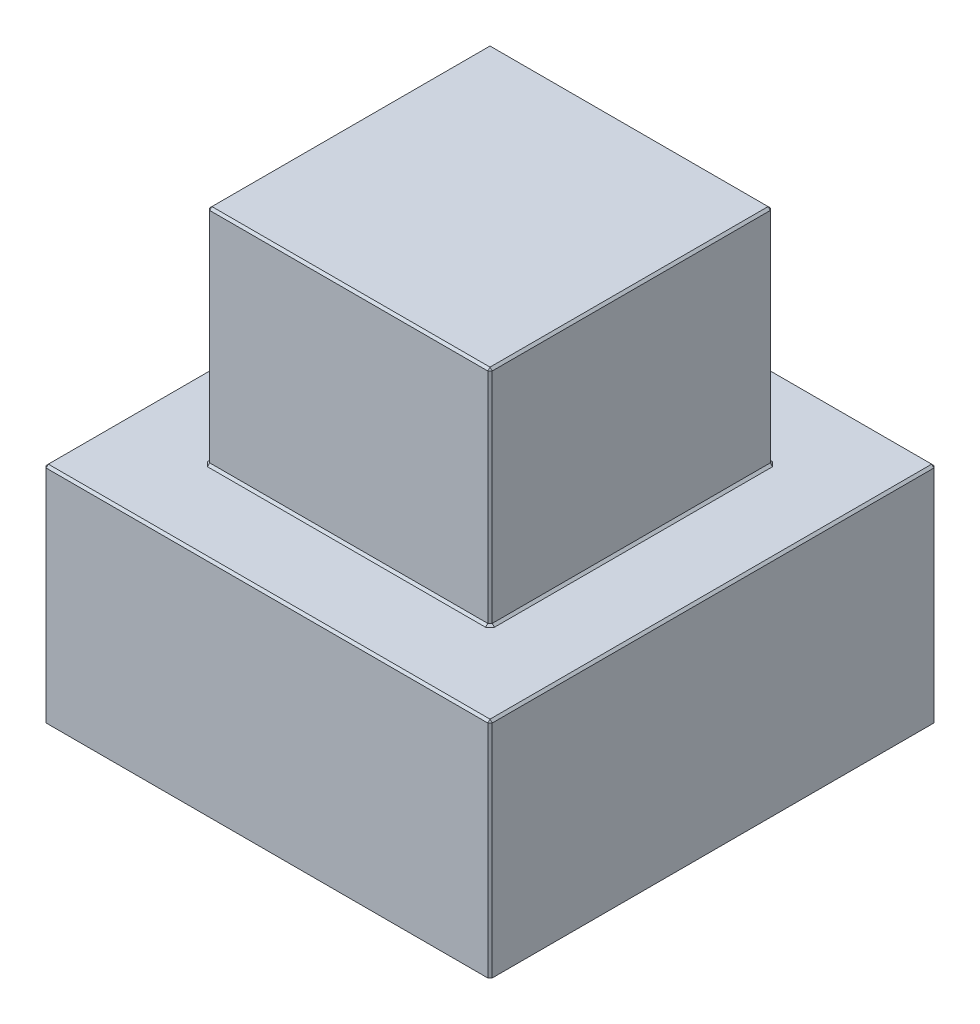
ISO-10303-21;
HEADER;
FILE_DESCRIPTION(('STEP AP214'),'2;1');
FILE_NAME('part.step','',(''),(''),'','','');
FILE_SCHEMA(('AUTOMOTIVE_DESIGN { 1 0 10303 214 1 1 1 1 }'));
ENDSEC;
DATA;
#1=APPLICATION_CONTEXT('core data for automotive mechanical design processes');
#2=APPLICATION_PROTOCOL_DEFINITION('international standard','automotive_design',2000,#1);
#3=PRODUCT_CONTEXT('',#1,'mechanical');
#4=PRODUCT('Part','Part','',(#3));
#5=PRODUCT_RELATED_PRODUCT_CATEGORY('part','',(#4));
#6=PRODUCT_DEFINITION_FORMATION('','',#4);
#7=PRODUCT_DEFINITION_CONTEXT('part definition',#1,'design');
#8=PRODUCT_DEFINITION('design','',#6,#7);
#9=PRODUCT_DEFINITION_SHAPE('','',#8);
#10=(LENGTH_UNIT() NAMED_UNIT(*) SI_UNIT(.MILLI.,.METRE.));
#11=(NAMED_UNIT(*) PLANE_ANGLE_UNIT() SI_UNIT($,.RADIAN.));
#12=(NAMED_UNIT(*) SI_UNIT($,.STERADIAN.) SOLID_ANGLE_UNIT());
#13=UNCERTAINTY_MEASURE_WITH_UNIT(LENGTH_MEASURE(1.E-05),#10,'distance_accuracy_value','');
#14=(GEOMETRIC_REPRESENTATION_CONTEXT(3) GLOBAL_UNCERTAINTY_ASSIGNED_CONTEXT((#13)) GLOBAL_UNIT_ASSIGNED_CONTEXT((#10,
#11,#12)) REPRESENTATION_CONTEXT('',''));
#15=CARTESIAN_POINT('',(0.,0.,0.));
#16=DIRECTION('',(0.,0.,1.));
#17=DIRECTION('',(1.,0.,0.));
#18=AXIS2_PLACEMENT_3D('',#15,#16,#17);
#19=CARTESIAN_POINT('',(0.,3.,0.));
#20=DIRECTION('',(0.,-1.,0.));
#21=DIRECTION('',(0.,0.,-1.));
#22=AXIS2_PLACEMENT_3D('',#19,#20,#21);
#23=PLANE('',#22);
#24=DIRECTION('',(1.,0.,0.));
#25=VECTOR('',#24,1.);
#26=CARTESIAN_POINT('',(0.,3.,2.97));
#27=LINE('',#26,#25);
#28=CARTESIAN_POINT('',(-2.97,3.,2.97));
#29=VERTEX_POINT('',#28);
#30=CARTESIAN_POINT('',(2.97,3.,2.97));
#31=VERTEX_POINT('',#30);
#32=EDGE_CURVE('E447',#29,#31,#27,.T.);
#33=ORIENTED_EDGE('',*,*,#32,.T.);
#34=DIRECTION('',(0.,0.,-1.));
#35=VECTOR('',#34,1.);
#36=CARTESIAN_POINT('',(2.97,3.,0.));
#37=LINE('',#36,#35);
#38=CARTESIAN_POINT('',(2.97,3.,-2.97));
#39=VERTEX_POINT('',#38);
#40=EDGE_CURVE('E449',#31,#39,#37,.T.);
#41=ORIENTED_EDGE('',*,*,#40,.T.);
#42=DIRECTION('',(-1.,0.,0.));
#43=VECTOR('',#42,1.);
#44=CARTESIAN_POINT('',(0.,3.,-2.97));
#45=LINE('',#44,#43);
#46=CARTESIAN_POINT('',(-2.97,3.,-2.97));
#47=VERTEX_POINT('',#46);
#48=EDGE_CURVE('E443',#39,#47,#45,.T.);
#49=ORIENTED_EDGE('',*,*,#48,.T.);
#50=DIRECTION('',(0.,0.,1.));
#51=VECTOR('',#50,1.);
#52=CARTESIAN_POINT('',(-2.97,3.,0.));
#53=LINE('',#52,#51);
#54=EDGE_CURVE('E445',#47,#29,#53,.T.);
#55=ORIENTED_EDGE('',*,*,#54,.T.);
#56=EDGE_LOOP('',(#33,#41,#49,#55));
#57=FACE_BOUND('',#56,.T.);
#58=DIRECTION('',(-0.707106781186548,0.,-0.707106781186548));
#59=VECTOR('',#58,1.);
#60=CARTESIAN_POINT('',(1.87,3.,-1.93));
#61=LINE('',#60,#59);
#62=CARTESIAN_POINT('',(1.9,3.,-1.9));
#63=VERTEX_POINT('',#62);
#64=CARTESIAN_POINT('',(1.87,3.,-1.93));
#65=VERTEX_POINT('',#64);
#66=EDGE_CURVE('E239',#63,#65,#61,.T.);
#67=ORIENTED_EDGE('',*,*,#66,.F.);
#68=DIRECTION('',(-0.707106781186548,0.,-0.707106781186548));
#69=VECTOR('',#68,1.);
#70=CARTESIAN_POINT('',(1.87,3.,-1.93));
#71=LINE('',#70,#69);
#72=CARTESIAN_POINT('',(1.93,3.,-1.87));
#73=VERTEX_POINT('',#72);
#74=EDGE_CURVE('E234',#73,#63,#71,.T.);
#75=ORIENTED_EDGE('',*,*,#74,.F.);
#76=DIRECTION('',(0.,0.,1.));
#77=VECTOR('',#76,1.);
#78=CARTESIAN_POINT('',(1.93,3.,1.9));
#79=LINE('',#78,#77);
#80=CARTESIAN_POINT('',(1.93,3.,1.87));
#81=VERTEX_POINT('',#80);
#82=EDGE_CURVE('E229',#73,#81,#79,.T.);
#83=ORIENTED_EDGE('',*,*,#82,.T.);
#84=DIRECTION('',(0.707106781186548,0.,-0.707106781186548));
#85=VECTOR('',#84,1.);
#86=CARTESIAN_POINT('',(1.93,3.,1.87));
#87=LINE('',#86,#85);
#88=CARTESIAN_POINT('',(1.9,3.,1.9));
#89=VERTEX_POINT('',#88);
#90=EDGE_CURVE('E226',#89,#81,#87,.T.);
#91=ORIENTED_EDGE('',*,*,#90,.F.);
#92=DIRECTION('',(0.707106781186548,0.,-0.707106781186548));
#93=VECTOR('',#92,1.);
#94=CARTESIAN_POINT('',(1.93,3.,1.87));
#95=LINE('',#94,#93);
#96=CARTESIAN_POINT('',(1.87,3.,1.93));
#97=VERTEX_POINT('',#96);
#98=EDGE_CURVE('E219',#97,#89,#95,.T.);
#99=ORIENTED_EDGE('',*,*,#98,.F.);
#100=DIRECTION('',(-1.,0.,0.));
#101=VECTOR('',#100,1.);
#102=CARTESIAN_POINT('',(-1.9,3.,1.93));
#103=LINE('',#102,#101);
#104=CARTESIAN_POINT('',(-1.87,3.,1.93));
#105=VERTEX_POINT('',#104);
#106=EDGE_CURVE('E458',#97,#105,#103,.T.);
#107=ORIENTED_EDGE('',*,*,#106,.T.);
#108=DIRECTION('',(0.707106781186548,0.,0.707106781186548));
#109=VECTOR('',#108,1.);
#110=CARTESIAN_POINT('',(-1.87,3.,1.93));
#111=LINE('',#110,#109);
#112=CARTESIAN_POINT('',(-1.9,3.,1.9));
#113=VERTEX_POINT('',#112);
#114=EDGE_CURVE('E452',#113,#105,#111,.T.);
#115=ORIENTED_EDGE('',*,*,#114,.F.);
#116=DIRECTION('',(0.707106781186548,0.,0.707106781186548));
#117=VECTOR('',#116,1.);
#118=CARTESIAN_POINT('',(-1.87,3.,1.93));
#119=LINE('',#118,#117);
#120=CARTESIAN_POINT('',(-1.93,3.,1.87));
#121=VERTEX_POINT('',#120);
#122=EDGE_CURVE('E455',#121,#113,#119,.T.);
#123=ORIENTED_EDGE('',*,*,#122,.F.);
#124=DIRECTION('',(0.,0.,-1.));
#125=VECTOR('',#124,1.);
#126=CARTESIAN_POINT('',(-1.93,3.,-1.9));
#127=LINE('',#126,#125);
#128=CARTESIAN_POINT('',(-1.93,3.,-1.87));
#129=VERTEX_POINT('',#128);
#130=EDGE_CURVE('E216',#121,#129,#127,.T.);
#131=ORIENTED_EDGE('',*,*,#130,.T.);
#132=DIRECTION('',(-0.707106781186548,0.,0.707106781186548));
#133=VECTOR('',#132,1.);
#134=CARTESIAN_POINT('',(-1.93,3.,-1.87));
#135=LINE('',#134,#133);
#136=CARTESIAN_POINT('',(-1.9,3.,-1.9));
#137=VERTEX_POINT('',#136);
#138=EDGE_CURVE('E210',#137,#129,#135,.T.);
#139=ORIENTED_EDGE('',*,*,#138,.F.);
#140=DIRECTION('',(-0.707106781186548,0.,0.707106781186548));
#141=VECTOR('',#140,1.);
#142=CARTESIAN_POINT('',(-1.93,3.,-1.87));
#143=LINE('',#142,#141);
#144=CARTESIAN_POINT('',(-1.87,3.,-1.93));
#145=VERTEX_POINT('',#144);
#146=EDGE_CURVE('E213',#145,#137,#143,.T.);
#147=ORIENTED_EDGE('',*,*,#146,.F.);
#148=DIRECTION('',(1.,0.,0.));
#149=VECTOR('',#148,1.);
#150=CARTESIAN_POINT('',(1.9,3.,-1.93));
#151=LINE('',#150,#149);
#152=EDGE_CURVE('E237',#145,#65,#151,.T.);
#153=ORIENTED_EDGE('',*,*,#152,.T.);
#154=EDGE_LOOP('',(#67,#75,#83,#91,#99,#107,#115,#123,#131,#139,#147,#153));
#155=FACE_BOUND('',#154,.T.);
#156=ADVANCED_FACE('F39',(#57,#155),#23,.F.);
#157=CARTESIAN_POINT('',(3.,3.,3.));
#158=DIRECTION('',(-1.,0.,0.));
#159=DIRECTION('',(0.,0.,1.));
#160=AXIS2_PLACEMENT_3D('',#157,#158,#159);
#161=PLANE('',#160);
#162=DIRECTION('',(0.,0.,1.));
#163=VECTOR('',#162,1.);
#164=CARTESIAN_POINT('',(3.,2.97,3.));
#165=LINE('',#164,#163);
#166=CARTESIAN_POINT('',(3.,2.97,-2.97));
#167=VERTEX_POINT('',#166);
#168=CARTESIAN_POINT('',(3.,2.97,2.97));
#169=VERTEX_POINT('',#168);
#170=EDGE_CURVE('E273',#167,#169,#165,.T.);
#171=ORIENTED_EDGE('',*,*,#170,.T.);
#172=DIRECTION('',(0.,-1.,0.));
#173=VECTOR('',#172,1.);
#174=CARTESIAN_POINT('',(3.,3.,2.97));
#175=LINE('',#174,#173);
#176=CARTESIAN_POINT('',(3.,0.,2.97));
#177=VERTEX_POINT('',#176);
#178=EDGE_CURVE('E275',#169,#177,#175,.T.);
#179=ORIENTED_EDGE('',*,*,#178,.T.);
#180=DIRECTION('',(0.,0.,-1.));
#181=VECTOR('',#180,1.);
#182=CARTESIAN_POINT('',(3.,0.,3.));
#183=LINE('',#182,#181);
#184=CARTESIAN_POINT('',(3.,0.,-2.97));
#185=VERTEX_POINT('',#184);
#186=EDGE_CURVE('E345',#177,#185,#183,.T.);
#187=ORIENTED_EDGE('',*,*,#186,.T.);
#188=DIRECTION('',(0.,1.,0.));
#189=VECTOR('',#188,1.);
#190=CARTESIAN_POINT('',(3.,3.,-2.97));
#191=LINE('',#190,#189);
#192=EDGE_CURVE('E271',#185,#167,#191,.T.);
#193=ORIENTED_EDGE('',*,*,#192,.T.);
#194=EDGE_LOOP('',(#171,#179,#187,#193));
#195=FACE_BOUND('',#194,.T.);
#196=ADVANCED_FACE('F530',(#195),#161,.F.);
#197=CARTESIAN_POINT('',(-3.,3.,-3.));
#198=DIRECTION('',(0.,0.,1.));
#199=DIRECTION('',(1.,0.,0.));
#200=AXIS2_PLACEMENT_3D('',#197,#198,#199);
#201=PLANE('',#200);
#202=DIRECTION('',(-1.,0.,0.));
#203=VECTOR('',#202,1.);
#204=CARTESIAN_POINT('',(-3.,0.,-3.));
#205=LINE('',#204,#203);
#206=CARTESIAN_POINT('',(2.97,0.,-3.));
#207=VERTEX_POINT('',#206);
#208=CARTESIAN_POINT('',(-2.97,0.,-3.));
#209=VERTEX_POINT('',#208);
#210=EDGE_CURVE('E390',#207,#209,#205,.T.);
#211=ORIENTED_EDGE('',*,*,#210,.T.);
#212=DIRECTION('',(0.,1.,0.));
#213=VECTOR('',#212,1.);
#214=CARTESIAN_POINT('',(-2.97,3.,-3.));
#215=LINE('',#214,#213);
#216=CARTESIAN_POINT('',(-2.97,2.97,-3.));
#217=VERTEX_POINT('',#216);
#218=EDGE_CURVE('E11',#209,#217,#215,.T.);
#219=ORIENTED_EDGE('',*,*,#218,.T.);
#220=DIRECTION('',(1.,0.,0.));
#221=VECTOR('',#220,1.);
#222=CARTESIAN_POINT('',(-3.,2.97,-3.));
#223=LINE('',#222,#221);
#224=CARTESIAN_POINT('',(2.97,2.97,-3.));
#225=VERTEX_POINT('',#224);
#226=EDGE_CURVE('E49',#217,#225,#223,.T.);
#227=ORIENTED_EDGE('',*,*,#226,.T.);
#228=DIRECTION('',(0.,-1.,0.));
#229=VECTOR('',#228,1.);
#230=CARTESIAN_POINT('',(2.97,3.,-3.));
#231=LINE('',#230,#229);
#232=EDGE_CURVE('E277',#225,#207,#231,.T.);
#233=ORIENTED_EDGE('',*,*,#232,.T.);
#234=EDGE_LOOP('',(#211,#219,#227,#233));
#235=FACE_BOUND('',#234,.T.);
#236=ADVANCED_FACE('F389',(#235),#201,.F.);
#237=CARTESIAN_POINT('',(-3.,3.,3.));
#238=DIRECTION('',(1.,0.,0.));
#239=DIRECTION('',(0.,0.,-1.));
#240=AXIS2_PLACEMENT_3D('',#237,#238,#239);
#241=PLANE('',#240);
#242=DIRECTION('',(0.,0.,1.));
#243=VECTOR('',#242,1.);
#244=CARTESIAN_POINT('',(-3.,0.,3.));
#245=LINE('',#244,#243);
#246=CARTESIAN_POINT('',(-3.,0.,-2.97));
#247=VERTEX_POINT('',#246);
#248=CARTESIAN_POINT('',(-3.,0.,2.97));
#249=VERTEX_POINT('',#248);
#250=EDGE_CURVE('E398',#247,#249,#245,.T.);
#251=ORIENTED_EDGE('',*,*,#250,.T.);
#252=DIRECTION('',(0.,1.,0.));
#253=VECTOR('',#252,1.);
#254=CARTESIAN_POINT('',(-3.,3.,2.97));
#255=LINE('',#254,#253);
#256=CARTESIAN_POINT('',(-3.,2.97,2.97));
#257=VERTEX_POINT('',#256);
#258=EDGE_CURVE('E269',#249,#257,#255,.T.);
#259=ORIENTED_EDGE('',*,*,#258,.T.);
#260=DIRECTION('',(0.,0.,-1.));
#261=VECTOR('',#260,1.);
#262=CARTESIAN_POINT('',(-3.,2.97,3.));
#263=LINE('',#262,#261);
#264=CARTESIAN_POINT('',(-3.,2.97,-2.97));
#265=VERTEX_POINT('',#264);
#266=EDGE_CURVE('E267',#257,#265,#263,.T.);
#267=ORIENTED_EDGE('',*,*,#266,.T.);
#268=DIRECTION('',(0.,-1.,0.));
#269=VECTOR('',#268,1.);
#270=CARTESIAN_POINT('',(-3.,3.,-2.97));
#271=LINE('',#270,#269);
#272=EDGE_CURVE('E265',#265,#247,#271,.T.);
#273=ORIENTED_EDGE('',*,*,#272,.T.);
#274=EDGE_LOOP('',(#251,#259,#267,#273));
#275=FACE_BOUND('',#274,.T.);
#276=ADVANCED_FACE('F547',(#275),#241,.F.);
#277=CARTESIAN_POINT('',(-3.,3.,3.));
#278=DIRECTION('',(0.,0.,-1.));
#279=DIRECTION('',(-1.,0.,0.));
#280=AXIS2_PLACEMENT_3D('',#277,#278,#279);
#281=PLANE('',#280);
#282=DIRECTION('',(-1.,0.,0.));
#283=VECTOR('',#282,1.);
#284=CARTESIAN_POINT('',(-3.,2.97,3.));
#285=LINE('',#284,#283);
#286=CARTESIAN_POINT('',(2.97,2.97,3.));
#287=VERTEX_POINT('',#286);
#288=CARTESIAN_POINT('',(-2.97,2.97,3.));
#289=VERTEX_POINT('',#288);
#290=EDGE_CURVE('E250',#287,#289,#285,.T.);
#291=ORIENTED_EDGE('',*,*,#290,.T.);
#292=DIRECTION('',(0.,-1.,0.));
#293=VECTOR('',#292,1.);
#294=CARTESIAN_POINT('',(-2.97,3.,3.));
#295=LINE('',#294,#293);
#296=CARTESIAN_POINT('',(-2.97,0.,3.));
#297=VERTEX_POINT('',#296);
#298=EDGE_CURVE('E254',#289,#297,#295,.T.);
#299=ORIENTED_EDGE('',*,*,#298,.T.);
#300=DIRECTION('',(1.,0.,0.));
#301=VECTOR('',#300,1.);
#302=CARTESIAN_POINT('',(-3.,0.,3.));
#303=LINE('',#302,#301);
#304=CARTESIAN_POINT('',(2.97,0.,3.));
#305=VERTEX_POINT('',#304);
#306=EDGE_CURVE('E401',#297,#305,#303,.T.);
#307=ORIENTED_EDGE('',*,*,#306,.T.);
#308=DIRECTION('',(0.,1.,0.));
#309=VECTOR('',#308,1.);
#310=CARTESIAN_POINT('',(2.97,3.,3.));
#311=LINE('',#310,#309);
#312=EDGE_CURVE('E252',#305,#287,#311,.T.);
#313=ORIENTED_EDGE('',*,*,#312,.T.);
#314=EDGE_LOOP('',(#291,#299,#307,#313));
#315=FACE_BOUND('',#314,.T.);
#316=ADVANCED_FACE('F544',(#315),#281,.F.);
#317=CARTESIAN_POINT('',(0.,0.,0.));
#318=DIRECTION('',(0.,-1.,0.));
#319=DIRECTION('',(0.,0.,-1.));
#320=AXIS2_PLACEMENT_3D('',#317,#318,#319);
#321=PLANE('',#320);
#322=ORIENTED_EDGE('',*,*,#306,.F.);
#323=DIRECTION('',(0.707106781186548,0.,0.707106781186548));
#324=VECTOR('',#323,1.);
#325=CARTESIAN_POINT('',(-2.985,0.,2.985));
#326=LINE('',#325,#324);
#327=EDGE_CURVE('E263',#297,#249,#326,.F.);
#328=ORIENTED_EDGE('',*,*,#327,.T.);
#329=ORIENTED_EDGE('',*,*,#250,.F.);
#330=DIRECTION('',(-0.707106781186548,0.,0.707106781186548));
#331=VECTOR('',#330,1.);
#332=CARTESIAN_POINT('',(-2.985,0.,-2.985));
#333=LINE('',#332,#331);
#334=EDGE_CURVE('E259',#247,#209,#333,.F.);
#335=ORIENTED_EDGE('',*,*,#334,.T.);
#336=ORIENTED_EDGE('',*,*,#210,.F.);
#337=DIRECTION('',(-0.707106781186548,0.,-0.707106781186548));
#338=VECTOR('',#337,1.);
#339=CARTESIAN_POINT('',(2.985,0.,-2.985));
#340=LINE('',#339,#338);
#341=EDGE_CURVE('E257',#207,#185,#340,.F.);
#342=ORIENTED_EDGE('',*,*,#341,.T.);
#343=ORIENTED_EDGE('',*,*,#186,.F.);
#344=DIRECTION('',(0.707106781186548,0.,-0.707106781186548));
#345=VECTOR('',#344,1.);
#346=CARTESIAN_POINT('',(2.985,0.,2.985));
#347=LINE('',#346,#345);
#348=EDGE_CURVE('E261',#177,#305,#347,.F.);
#349=ORIENTED_EDGE('',*,*,#348,.T.);
#350=EDGE_LOOP('',(#322,#328,#329,#335,#336,#342,#343,#349));
#351=FACE_BOUND('',#350,.T.);
#352=ADVANCED_FACE('F393',(#351),#321,.T.);
#353=CARTESIAN_POINT('',(1.9,6.,1.9));
#354=DIRECTION('',(-1.,0.,0.));
#355=DIRECTION('',(0.,0.,1.));
#356=AXIS2_PLACEMENT_3D('',#353,#354,#355);
#357=PLANE('',#356);
#358=DIRECTION('',(0.,0.,-1.));
#359=VECTOR('',#358,1.);
#360=CARTESIAN_POINT('',(1.9,3.03,-1.9));
#361=LINE('',#360,#359);
#362=CARTESIAN_POINT('',(1.9,3.03,1.87));
#363=VERTEX_POINT('',#362);
#364=CARTESIAN_POINT('',(1.9,3.03,-1.87));
#365=VERTEX_POINT('',#364);
#366=EDGE_CURVE('E420',#363,#365,#361,.T.);
#367=ORIENTED_EDGE('',*,*,#366,.T.);
#368=DIRECTION('',(0.,1.,0.));
#369=VECTOR('',#368,1.);
#370=CARTESIAN_POINT('',(1.9,6.,-1.87));
#371=LINE('',#370,#369);
#372=CARTESIAN_POINT('',(1.9,5.97,-1.87));
#373=VERTEX_POINT('',#372);
#374=EDGE_CURVE('E422',#365,#373,#371,.T.);
#375=ORIENTED_EDGE('',*,*,#374,.T.);
#376=DIRECTION('',(0.,0.,1.));
#377=VECTOR('',#376,1.);
#378=CARTESIAN_POINT('',(1.9,5.97,1.9));
#379=LINE('',#378,#377);
#380=CARTESIAN_POINT('',(1.9,5.97,1.87));
#381=VERTEX_POINT('',#380);
#382=EDGE_CURVE('E418',#373,#381,#379,.T.);
#383=ORIENTED_EDGE('',*,*,#382,.T.);
#384=DIRECTION('',(0.,-1.,0.));
#385=VECTOR('',#384,1.);
#386=CARTESIAN_POINT('',(1.9,6.,1.87));
#387=LINE('',#386,#385);
#388=EDGE_CURVE('E416',#381,#363,#387,.T.);
#389=ORIENTED_EDGE('',*,*,#388,.T.);
#390=EDGE_LOOP('',(#367,#375,#383,#389));
#391=FACE_BOUND('',#390,.T.);
#392=ADVANCED_FACE('F540',(#391),#357,.F.);
#393=CARTESIAN_POINT('',(-1.9,6.,-1.9));
#394=DIRECTION('',(0.,0.,1.));
#395=DIRECTION('',(1.,0.,0.));
#396=AXIS2_PLACEMENT_3D('',#393,#394,#395);
#397=PLANE('',#396);
#398=DIRECTION('',(1.,0.,0.));
#399=VECTOR('',#398,1.);
#400=CARTESIAN_POINT('',(-1.9,5.97,-1.9));
#401=LINE('',#400,#399);
#402=CARTESIAN_POINT('',(-1.87,5.97,-1.9));
#403=VERTEX_POINT('',#402);
#404=CARTESIAN_POINT('',(1.87,5.97,-1.9));
#405=VERTEX_POINT('',#404);
#406=EDGE_CURVE('E411',#403,#405,#401,.T.);
#407=ORIENTED_EDGE('',*,*,#406,.T.);
#408=DIRECTION('',(0.,-1.,0.));
#409=VECTOR('',#408,1.);
#410=CARTESIAN_POINT('',(1.87,6.,-1.9));
#411=LINE('',#410,#409);
#412=CARTESIAN_POINT('',(1.87,3.03,-1.9));
#413=VERTEX_POINT('',#412);
#414=EDGE_CURVE('E413',#405,#413,#411,.T.);
#415=ORIENTED_EDGE('',*,*,#414,.T.);
#416=DIRECTION('',(-1.,0.,0.));
#417=VECTOR('',#416,1.);
#418=CARTESIAN_POINT('',(-1.9,3.03,-1.9));
#419=LINE('',#418,#417);
#420=CARTESIAN_POINT('',(-1.87,3.03,-1.9));
#421=VERTEX_POINT('',#420);
#422=EDGE_CURVE('E407',#413,#421,#419,.T.);
#423=ORIENTED_EDGE('',*,*,#422,.T.);
#424=DIRECTION('',(0.,1.,0.));
#425=VECTOR('',#424,1.);
#426=CARTESIAN_POINT('',(-1.87,6.,-1.9));
#427=LINE('',#426,#425);
#428=EDGE_CURVE('E409',#421,#403,#427,.T.);
#429=ORIENTED_EDGE('',*,*,#428,.T.);
#430=EDGE_LOOP('',(#407,#415,#423,#429));
#431=FACE_BOUND('',#430,.T.);
#432=ADVANCED_FACE('F852',(#431),#397,.F.);
#433=CARTESIAN_POINT('',(-1.9,6.,1.9));
#434=DIRECTION('',(1.,0.,0.));
#435=DIRECTION('',(0.,0.,-1.));
#436=AXIS2_PLACEMENT_3D('',#433,#434,#435);
#437=PLANE('',#436);
#438=DIRECTION('',(0.,-1.,0.));
#439=VECTOR('',#438,1.);
#440=CARTESIAN_POINT('',(-1.9,6.,-1.87));
#441=LINE('',#440,#439);
#442=CARTESIAN_POINT('',(-1.9,5.97,-1.87));
#443=VERTEX_POINT('',#442);
#444=CARTESIAN_POINT('',(-1.9,3.03,-1.87));
#445=VERTEX_POINT('',#444);
#446=EDGE_CURVE('E438',#443,#445,#441,.T.);
#447=ORIENTED_EDGE('',*,*,#446,.T.);
#448=DIRECTION('',(0.,0.,1.));
#449=VECTOR('',#448,1.);
#450=CARTESIAN_POINT('',(-1.9,3.03,1.9));
#451=LINE('',#450,#449);
#452=CARTESIAN_POINT('',(-1.9,3.03,1.87));
#453=VERTEX_POINT('',#452);
#454=EDGE_CURVE('E441',#445,#453,#451,.T.);
#455=ORIENTED_EDGE('',*,*,#454,.T.);
#456=DIRECTION('',(0.,1.,0.));
#457=VECTOR('',#456,1.);
#458=CARTESIAN_POINT('',(-1.9,6.,1.87));
#459=LINE('',#458,#457);
#460=CARTESIAN_POINT('',(-1.9,5.97,1.87));
#461=VERTEX_POINT('',#460);
#462=EDGE_CURVE('E436',#453,#461,#459,.T.);
#463=ORIENTED_EDGE('',*,*,#462,.T.);
#464=DIRECTION('',(0.,0.,-1.));
#465=VECTOR('',#464,1.);
#466=CARTESIAN_POINT('',(-1.9,5.97,1.9));
#467=LINE('',#466,#465);
#468=EDGE_CURVE('E434',#461,#443,#467,.T.);
#469=ORIENTED_EDGE('',*,*,#468,.T.);
#470=EDGE_LOOP('',(#447,#455,#463,#469));
#471=FACE_BOUND('',#470,.T.);
#472=ADVANCED_FACE('F842',(#471),#437,.F.);
#473=CARTESIAN_POINT('',(-1.9,6.,1.9));
#474=DIRECTION('',(0.,0.,-1.));
#475=DIRECTION('',(-1.,0.,0.));
#476=AXIS2_PLACEMENT_3D('',#473,#474,#475);
#477=PLANE('',#476);
#478=DIRECTION('',(-1.,0.,0.));
#479=VECTOR('',#478,1.);
#480=CARTESIAN_POINT('',(-1.9,5.97,1.9));
#481=LINE('',#480,#479);
#482=CARTESIAN_POINT('',(1.87,5.97,1.9));
#483=VERTEX_POINT('',#482);
#484=CARTESIAN_POINT('',(-1.87,5.97,1.9));
#485=VERTEX_POINT('',#484);
#486=EDGE_CURVE('E243',#483,#485,#481,.T.);
#487=ORIENTED_EDGE('',*,*,#486,.T.);
#488=DIRECTION('',(0.,-1.,0.));
#489=VECTOR('',#488,1.);
#490=CARTESIAN_POINT('',(-1.87,6.,1.9));
#491=LINE('',#490,#489);
#492=CARTESIAN_POINT('',(-1.87,3.03,1.9));
#493=VERTEX_POINT('',#492);
#494=EDGE_CURVE('E247',#485,#493,#491,.T.);
#495=ORIENTED_EDGE('',*,*,#494,.T.);
#496=DIRECTION('',(1.,0.,0.));
#497=VECTOR('',#496,1.);
#498=CARTESIAN_POINT('',(1.9,3.03,1.9));
#499=LINE('',#498,#497);
#500=CARTESIAN_POINT('',(1.87,3.03,1.9));
#501=VERTEX_POINT('',#500);
#502=EDGE_CURVE('E245',#493,#501,#499,.T.);
#503=ORIENTED_EDGE('',*,*,#502,.T.);
#504=DIRECTION('',(0.,1.,0.));
#505=VECTOR('',#504,1.);
#506=CARTESIAN_POINT('',(1.87,6.,1.9));
#507=LINE('',#506,#505);
#508=EDGE_CURVE('E241',#501,#483,#507,.T.);
#509=ORIENTED_EDGE('',*,*,#508,.T.);
#510=EDGE_LOOP('',(#487,#495,#503,#509));
#511=FACE_BOUND('',#510,.T.);
#512=ADVANCED_FACE('F479',(#511),#477,.F.);
#513=CARTESIAN_POINT('',(0.,6.,0.));
#514=DIRECTION('',(0.,-1.,0.));
#515=DIRECTION('',(0.,0.,-1.));
#516=AXIS2_PLACEMENT_3D('',#513,#514,#515);
#517=PLANE('',#516);
#518=DIRECTION('',(0.,0.,-1.));
#519=VECTOR('',#518,1.);
#520=CARTESIAN_POINT('',(1.87,6.,0.));
#521=LINE('',#520,#519);
#522=CARTESIAN_POINT('',(1.87,6.,1.87));
#523=VERTEX_POINT('',#522);
#524=CARTESIAN_POINT('',(1.87,6.,-1.87));
#525=VERTEX_POINT('',#524);
#526=EDGE_CURVE('E429',#523,#525,#521,.T.);
#527=ORIENTED_EDGE('',*,*,#526,.T.);
#528=DIRECTION('',(-1.,0.,0.));
#529=VECTOR('',#528,1.);
#530=CARTESIAN_POINT('',(0.,6.,-1.87));
#531=LINE('',#530,#529);
#532=CARTESIAN_POINT('',(-1.87,6.,-1.87));
#533=VERTEX_POINT('',#532);
#534=EDGE_CURVE('E431',#525,#533,#531,.T.);
#535=ORIENTED_EDGE('',*,*,#534,.T.);
#536=DIRECTION('',(0.,0.,1.));
#537=VECTOR('',#536,1.);
#538=CARTESIAN_POINT('',(-1.87,6.,0.));
#539=LINE('',#538,#537);
#540=CARTESIAN_POINT('',(-1.87,6.,1.87));
#541=VERTEX_POINT('',#540);
#542=EDGE_CURVE('E427',#533,#541,#539,.T.);
#543=ORIENTED_EDGE('',*,*,#542,.T.);
#544=DIRECTION('',(1.,0.,0.));
#545=VECTOR('',#544,1.);
#546=CARTESIAN_POINT('',(0.,6.,1.87));
#547=LINE('',#546,#545);
#548=EDGE_CURVE('E425',#541,#523,#547,.T.);
#549=ORIENTED_EDGE('',*,*,#548,.T.);
#550=EDGE_LOOP('',(#527,#535,#543,#549));
#551=FACE_BOUND('',#550,.T.);
#552=ADVANCED_FACE('F502',(#551),#517,.F.);
#553=CARTESIAN_POINT('',(-1.87,6.,1.9));
#554=DIRECTION('',(0.707106781186548,0.,-0.707106781186548));
#555=DIRECTION('',(0.,-1.,0.));
#556=AXIS2_PLACEMENT_3D('',#553,#554,#555);
#557=PLANE('',#556);
#558=DIRECTION('',(-0.707106781186547,0.,-0.707106781186547));
#559=VECTOR('',#558,1.);
#560=CARTESIAN_POINT('',(-1.9,5.97,1.87));
#561=LINE('',#560,#559);
#562=EDGE_CURVE('E342',#461,#485,#561,.F.);
#563=ORIENTED_EDGE('',*,*,#562,.F.);
#564=ORIENTED_EDGE('',*,*,#462,.F.);
#565=DIRECTION('',(0.707106781186548,0.,0.707106781186548));
#566=VECTOR('',#565,1.);
#567=CARTESIAN_POINT('',(-1.87,3.03,1.9));
#568=LINE('',#567,#566);
#569=EDGE_CURVE('E339',#493,#453,#568,.F.);
#570=ORIENTED_EDGE('',*,*,#569,.F.);
#571=ORIENTED_EDGE('',*,*,#494,.F.);
#572=EDGE_LOOP('',(#563,#564,#570,#571));
#573=FACE_BOUND('',#572,.T.);
#574=ADVANCED_FACE('F477',(#573),#557,.F.);
#575=CARTESIAN_POINT('',(-1.9,5.97,1.87));
#576=DIRECTION('',(-0.577350269189626,0.577350269189626,0.577350269189626));
#577=DIRECTION('',(0.707106781186548,0.,0.707106781186548));
#578=AXIS2_PLACEMENT_3D('',#575,#576,#577);
#579=PLANE('',#578);
#580=DIRECTION('',(0.707106781186547,0.707106781186547,0.));
#581=VECTOR('',#580,1.);
#582=CARTESIAN_POINT('',(-1.9,5.97,1.87));
#583=LINE('',#582,#581);
#584=EDGE_CURVE('E333',#461,#541,#583,.T.);
#585=ORIENTED_EDGE('',*,*,#584,.F.);
#586=ORIENTED_EDGE('',*,*,#562,.T.);
#587=DIRECTION('',(0.,-0.707106781186547,0.707106781186547));
#588=VECTOR('',#587,1.);
#589=CARTESIAN_POINT('',(-1.87,5.985,1.885));
#590=LINE('',#589,#588);
#591=EDGE_CURVE('E336',#541,#485,#590,.T.);
#592=ORIENTED_EDGE('',*,*,#591,.F.);
#593=EDGE_LOOP('',(#585,#586,#592));
#594=FACE_BOUND('',#593,.T.);
#595=ADVANCED_FACE('F519',(#594),#579,.T.);
#596=CARTESIAN_POINT('',(-1.87,3.03,1.9));
#597=DIRECTION('',(0.577350269189626,-0.577350269189626,-0.577350269189626));
#598=DIRECTION('',(-0.707106781186547,0.,-0.707106781186547));
#599=AXIS2_PLACEMENT_3D('',#596,#597,#598);
#600=PLANE('',#599);
#601=DIRECTION('',(0.,0.707106781186548,-0.707106781186548));
#602=VECTOR('',#601,1.);
#603=CARTESIAN_POINT('',(-1.87,3.,1.93));
#604=LINE('',#603,#602);
#605=EDGE_CURVE('E327',#493,#105,#604,.F.);
#606=ORIENTED_EDGE('',*,*,#605,.F.);
#607=ORIENTED_EDGE('',*,*,#569,.T.);
#608=DIRECTION('',(-0.707106781186548,-0.707106781186548,0.));
#609=VECTOR('',#608,1.);
#610=CARTESIAN_POINT('',(-1.9,3.03,1.87));
#611=LINE('',#610,#609);
#612=EDGE_CURVE('E330',#121,#453,#611,.F.);
#613=ORIENTED_EDGE('',*,*,#612,.F.);
#614=ORIENTED_EDGE('',*,*,#122,.T.);
#615=ORIENTED_EDGE('',*,*,#114,.T.);
#616=EDGE_LOOP('',(#606,#607,#613,#614,#615));
#617=FACE_BOUND('',#616,.T.);
#618=ADVANCED_FACE('F471',(#617),#600,.F.);
#619=CARTESIAN_POINT('',(0.,6.,1.87));
#620=DIRECTION('',(0.,-0.707106781186548,-0.707106781186548));
#621=DIRECTION('',(1.,0.,0.));
#622=AXIS2_PLACEMENT_3D('',#619,#620,#621);
#623=PLANE('',#622);
#624=ORIENTED_EDGE('',*,*,#591,.T.);
#625=ORIENTED_EDGE('',*,*,#486,.F.);
#626=DIRECTION('',(0.,0.707106781186547,-0.707106781186547));
#627=VECTOR('',#626,1.);
#628=CARTESIAN_POINT('',(1.87,5.985,1.885));
#629=LINE('',#628,#627);
#630=EDGE_CURVE('E321',#523,#483,#629,.F.);
#631=ORIENTED_EDGE('',*,*,#630,.F.);
#632=ORIENTED_EDGE('',*,*,#548,.F.);
#633=EDGE_LOOP('',(#624,#625,#631,#632));
#634=FACE_BOUND('',#633,.T.);
#635=ADVANCED_FACE('F485',(#634),#623,.F.);
#636=CARTESIAN_POINT('',(-1.87,6.,0.));
#637=DIRECTION('',(0.707106781186548,-0.707106781186548,0.));
#638=DIRECTION('',(0.,0.,1.));
#639=AXIS2_PLACEMENT_3D('',#636,#637,#638);
#640=PLANE('',#639);
#641=ORIENTED_EDGE('',*,*,#584,.T.);
#642=ORIENTED_EDGE('',*,*,#542,.F.);
#643=DIRECTION('',(-0.707106781186547,-0.707106781186547,0.));
#644=VECTOR('',#643,1.);
#645=CARTESIAN_POINT('',(-1.87,6.,-1.87));
#646=LINE('',#645,#644);
#647=EDGE_CURVE('E318',#443,#533,#646,.F.);
#648=ORIENTED_EDGE('',*,*,#647,.F.);
#649=ORIENTED_EDGE('',*,*,#468,.F.);
#650=EDGE_LOOP('',(#641,#642,#648,#649));
#651=FACE_BOUND('',#650,.T.);
#652=ADVANCED_FACE('F516',(#651),#640,.F.);
#653=CARTESIAN_POINT('',(-1.9,6.,-1.87));
#654=DIRECTION('',(0.707106781186548,0.,0.707106781186548));
#655=DIRECTION('',(0.,-1.,0.));
#656=AXIS2_PLACEMENT_3D('',#653,#654,#655);
#657=PLANE('',#656);
#658=DIRECTION('',(-0.707106781186548,0.,0.707106781186548));
#659=VECTOR('',#658,1.);
#660=CARTESIAN_POINT('',(-1.9,3.03,-1.87));
#661=LINE('',#660,#659);
#662=EDGE_CURVE('E313',#445,#421,#661,.F.);
#663=ORIENTED_EDGE('',*,*,#662,.F.);
#664=ORIENTED_EDGE('',*,*,#446,.F.);
#665=DIRECTION('',(0.707106781186547,0.,-0.707106781186547));
#666=VECTOR('',#665,1.);
#667=CARTESIAN_POINT('',(-1.885,5.97,-1.885));
#668=LINE('',#667,#666);
#669=EDGE_CURVE('E315',#403,#443,#668,.F.);
#670=ORIENTED_EDGE('',*,*,#669,.F.);
#671=ORIENTED_EDGE('',*,*,#428,.F.);
#672=EDGE_LOOP('',(#663,#664,#670,#671));
#673=FACE_BOUND('',#672,.T.);
#674=ADVANCED_FACE('F636',(#673),#657,.F.);
#675=CARTESIAN_POINT('',(-1.9,3.03,1.9));
#676=DIRECTION('',(-0.707106781186548,0.707106781186548,0.));
#677=DIRECTION('',(0.,0.,-1.));
#678=AXIS2_PLACEMENT_3D('',#675,#676,#677);
#679=PLANE('',#678);
#680=ORIENTED_EDGE('',*,*,#612,.T.);
#681=ORIENTED_EDGE('',*,*,#454,.F.);
#682=DIRECTION('',(0.707106781186548,0.707106781186548,0.));
#683=VECTOR('',#682,1.);
#684=CARTESIAN_POINT('',(-1.93,3.,-1.87));
#685=LINE('',#684,#683);
#686=EDGE_CURVE('E311',#129,#445,#685,.T.);
#687=ORIENTED_EDGE('',*,*,#686,.F.);
#688=ORIENTED_EDGE('',*,*,#130,.F.);
#689=EDGE_LOOP('',(#680,#681,#687,#688));
#690=FACE_BOUND('',#689,.T.);
#691=ADVANCED_FACE('F630',(#690),#679,.T.);
#692=CARTESIAN_POINT('',(-1.9,3.03,1.9));
#693=DIRECTION('',(0.,0.707106781186548,0.707106781186548));
#694=DIRECTION('',(-1.,0.,0.));
#695=AXIS2_PLACEMENT_3D('',#692,#693,#694);
#696=PLANE('',#695);
#697=ORIENTED_EDGE('',*,*,#605,.T.);
#698=ORIENTED_EDGE('',*,*,#106,.F.);
#699=DIRECTION('',(0.,-0.707106781186548,0.707106781186548));
#700=VECTOR('',#699,1.);
#701=CARTESIAN_POINT('',(1.87,3.03,1.9));
#702=LINE('',#701,#700);
#703=EDGE_CURVE('E308',#501,#97,#702,.T.);
#704=ORIENTED_EDGE('',*,*,#703,.F.);
#705=ORIENTED_EDGE('',*,*,#502,.F.);
#706=EDGE_LOOP('',(#697,#698,#704,#705));
#707=FACE_BOUND('',#706,.T.);
#708=ADVANCED_FACE('F467',(#707),#696,.T.);
#709=CARTESIAN_POINT('',(1.9,6.,1.87));
#710=DIRECTION('',(-0.707106781186548,0.,-0.707106781186548));
#711=DIRECTION('',(0.,-1.,0.));
#712=AXIS2_PLACEMENT_3D('',#709,#710,#711);
#713=PLANE('',#712);
#714=DIRECTION('',(-0.707106781186547,0.,0.707106781186547));
#715=VECTOR('',#714,1.);
#716=CARTESIAN_POINT('',(1.9,5.97,1.87));
#717=LINE('',#716,#715);
#718=EDGE_CURVE('E324',#483,#381,#717,.F.);
#719=ORIENTED_EDGE('',*,*,#718,.F.);
#720=ORIENTED_EDGE('',*,*,#508,.F.);
#721=DIRECTION('',(0.707106781186548,0.,-0.707106781186548));
#722=VECTOR('',#721,1.);
#723=CARTESIAN_POINT('',(1.9,3.03,1.87));
#724=LINE('',#723,#722);
#725=EDGE_CURVE('E305',#363,#501,#724,.F.);
#726=ORIENTED_EDGE('',*,*,#725,.F.);
#727=ORIENTED_EDGE('',*,*,#388,.F.);
#728=EDGE_LOOP('',(#719,#720,#726,#727));
#729=FACE_BOUND('',#728,.T.);
#730=ADVANCED_FACE('F491',(#729),#713,.F.);
#731=CARTESIAN_POINT('',(1.9,5.97,1.87));
#732=DIRECTION('',(0.577350269189626,0.577350269189626,0.577350269189626));
#733=DIRECTION('',(0.707106781186548,0.,-0.707106781186548));
#734=AXIS2_PLACEMENT_3D('',#731,#732,#733);
#735=PLANE('',#734);
#736=ORIENTED_EDGE('',*,*,#630,.T.);
#737=ORIENTED_EDGE('',*,*,#718,.T.);
#738=DIRECTION('',(0.707106781186547,-0.707106781186547,0.));
#739=VECTOR('',#738,1.);
#740=CARTESIAN_POINT('',(1.9,5.97,1.87));
#741=LINE('',#740,#739);
#742=EDGE_CURVE('E302',#523,#381,#741,.T.);
#743=ORIENTED_EDGE('',*,*,#742,.F.);
#744=EDGE_LOOP('',(#736,#737,#743));
#745=FACE_BOUND('',#744,.T.);
#746=ADVANCED_FACE('F494',(#745),#735,.T.);
#747=CARTESIAN_POINT('',(-1.87,6.,-1.87));
#748=DIRECTION('',(-0.577350269189626,0.577350269189626,-0.577350269189626));
#749=DIRECTION('',(-0.707106781186548,0.,0.707106781186548));
#750=AXIS2_PLACEMENT_3D('',#747,#748,#749);
#751=PLANE('',#750);
#752=ORIENTED_EDGE('',*,*,#669,.T.);
#753=ORIENTED_EDGE('',*,*,#647,.T.);
#754=DIRECTION('',(0.,0.707106781186547,0.707106781186547));
#755=VECTOR('',#754,1.);
#756=CARTESIAN_POINT('',(-1.87,6.,-1.87));
#757=LINE('',#756,#755);
#758=EDGE_CURVE('E300',#403,#533,#757,.T.);
#759=ORIENTED_EDGE('',*,*,#758,.F.);
#760=EDGE_LOOP('',(#752,#753,#759));
#761=FACE_BOUND('',#760,.T.);
#762=ADVANCED_FACE('F512',(#761),#751,.T.);
#763=CARTESIAN_POINT('',(-1.9,3.03,-1.87));
#764=DIRECTION('',(0.577350269189626,-0.577350269189626,0.577350269189626));
#765=DIRECTION('',(0.707106781186547,0.,-0.707106781186547));
#766=AXIS2_PLACEMENT_3D('',#763,#764,#765);
#767=PLANE('',#766);
#768=ORIENTED_EDGE('',*,*,#686,.T.);
#769=ORIENTED_EDGE('',*,*,#662,.T.);
#770=DIRECTION('',(0.,-0.707106781186548,-0.707106781186548));
#771=VECTOR('',#770,1.);
#772=CARTESIAN_POINT('',(-1.87,3.03,-1.9));
#773=LINE('',#772,#771);
#774=EDGE_CURVE('E224',#145,#421,#773,.F.);
#775=ORIENTED_EDGE('',*,*,#774,.F.);
#776=ORIENTED_EDGE('',*,*,#146,.T.);
#777=ORIENTED_EDGE('',*,*,#138,.T.);
#778=EDGE_LOOP('',(#768,#769,#775,#776,#777));
#779=FACE_BOUND('',#778,.T.);
#780=ADVANCED_FACE('F221',(#779),#767,.F.);
#781=CARTESIAN_POINT('',(1.9,3.03,1.87));
#782=DIRECTION('',(-0.577350269189626,-0.577350269189626,-0.577350269189626));
#783=DIRECTION('',(-0.707106781186547,0.,0.707106781186547));
#784=AXIS2_PLACEMENT_3D('',#781,#782,#783);
#785=PLANE('',#784);
#786=ORIENTED_EDGE('',*,*,#98,.T.);
#787=ORIENTED_EDGE('',*,*,#90,.T.);
#788=DIRECTION('',(-0.707106781186548,0.707106781186548,0.));
#789=VECTOR('',#788,1.);
#790=CARTESIAN_POINT('',(1.93,3.,1.87));
#791=LINE('',#790,#789);
#792=EDGE_CURVE('E296',#363,#81,#791,.F.);
#793=ORIENTED_EDGE('',*,*,#792,.F.);
#794=ORIENTED_EDGE('',*,*,#725,.T.);
#795=ORIENTED_EDGE('',*,*,#703,.T.);
#796=EDGE_LOOP('',(#786,#787,#793,#794,#795));
#797=FACE_BOUND('',#796,.T.);
#798=ADVANCED_FACE('F462',(#797),#785,.F.);
#799=CARTESIAN_POINT('',(1.87,6.,0.));
#800=DIRECTION('',(-0.707106781186548,-0.707106781186548,0.));
#801=DIRECTION('',(0.,0.,-1.));
#802=AXIS2_PLACEMENT_3D('',#799,#800,#801);
#803=PLANE('',#802);
#804=ORIENTED_EDGE('',*,*,#742,.T.);
#805=ORIENTED_EDGE('',*,*,#382,.F.);
#806=DIRECTION('',(-0.707106781186547,0.707106781186547,0.));
#807=VECTOR('',#806,1.);
#808=CARTESIAN_POINT('',(1.9,5.97,-1.87));
#809=LINE('',#808,#807);
#810=EDGE_CURVE('E293',#525,#373,#809,.F.);
#811=ORIENTED_EDGE('',*,*,#810,.F.);
#812=ORIENTED_EDGE('',*,*,#526,.F.);
#813=EDGE_LOOP('',(#804,#805,#811,#812));
#814=FACE_BOUND('',#813,.T.);
#815=ADVANCED_FACE('F499',(#814),#803,.F.);
#816=CARTESIAN_POINT('',(0.,6.,-1.87));
#817=DIRECTION('',(0.,-0.707106781186548,0.707106781186548));
#818=DIRECTION('',(-1.,0.,0.));
#819=AXIS2_PLACEMENT_3D('',#816,#817,#818);
#820=PLANE('',#819);
#821=ORIENTED_EDGE('',*,*,#758,.T.);
#822=ORIENTED_EDGE('',*,*,#534,.F.);
#823=DIRECTION('',(0.,-0.707106781186547,-0.707106781186547));
#824=VECTOR('',#823,1.);
#825=CARTESIAN_POINT('',(1.87,5.985,-1.885));
#826=LINE('',#825,#824);
#827=EDGE_CURVE('E290',#405,#525,#826,.F.);
#828=ORIENTED_EDGE('',*,*,#827,.F.);
#829=ORIENTED_EDGE('',*,*,#406,.F.);
#830=EDGE_LOOP('',(#821,#822,#828,#829));
#831=FACE_BOUND('',#830,.T.);
#832=ADVANCED_FACE('F505',(#831),#820,.F.);
#833=CARTESIAN_POINT('',(-1.9,3.03,-1.9));
#834=DIRECTION('',(0.,0.707106781186548,-0.707106781186548));
#835=DIRECTION('',(1.,0.,0.));
#836=AXIS2_PLACEMENT_3D('',#833,#834,#835);
#837=PLANE('',#836);
#838=ORIENTED_EDGE('',*,*,#774,.T.);
#839=ORIENTED_EDGE('',*,*,#422,.F.);
#840=DIRECTION('',(0.,0.707106781186548,0.707106781186548));
#841=VECTOR('',#840,1.);
#842=CARTESIAN_POINT('',(1.87,3.,-1.93));
#843=LINE('',#842,#841);
#844=EDGE_CURVE('E287',#65,#413,#843,.T.);
#845=ORIENTED_EDGE('',*,*,#844,.F.);
#846=ORIENTED_EDGE('',*,*,#152,.F.);
#847=EDGE_LOOP('',(#838,#839,#845,#846));
#848=FACE_BOUND('',#847,.T.);
#849=ADVANCED_FACE('F582',(#848),#837,.T.);
#850=CARTESIAN_POINT('',(1.9,3.03,1.9));
#851=DIRECTION('',(0.707106781186548,0.707106781186548,0.));
#852=DIRECTION('',(0.,0.,1.));
#853=AXIS2_PLACEMENT_3D('',#850,#851,#852);
#854=PLANE('',#853);
#855=ORIENTED_EDGE('',*,*,#792,.T.);
#856=ORIENTED_EDGE('',*,*,#82,.F.);
#857=DIRECTION('',(0.707106781186548,-0.707106781186548,0.));
#858=VECTOR('',#857,1.);
#859=CARTESIAN_POINT('',(1.9,3.03,-1.87));
#860=LINE('',#859,#858);
#861=EDGE_CURVE('E284',#365,#73,#860,.T.);
#862=ORIENTED_EDGE('',*,*,#861,.F.);
#863=ORIENTED_EDGE('',*,*,#366,.F.);
#864=EDGE_LOOP('',(#855,#856,#862,#863));
#865=FACE_BOUND('',#864,.T.);
#866=ADVANCED_FACE('F575',(#865),#854,.T.);
#867=CARTESIAN_POINT('',(1.9,5.97,-1.87));
#868=DIRECTION('',(0.577350269189626,0.577350269189626,-0.577350269189626));
#869=DIRECTION('',(-0.707106781186548,0.,-0.707106781186548));
#870=AXIS2_PLACEMENT_3D('',#867,#868,#869);
#871=PLANE('',#870);
#872=ORIENTED_EDGE('',*,*,#827,.T.);
#873=ORIENTED_EDGE('',*,*,#810,.T.);
#874=DIRECTION('',(0.707106781186547,0.,0.707106781186547));
#875=VECTOR('',#874,1.);
#876=CARTESIAN_POINT('',(1.9,5.97,-1.87));
#877=LINE('',#876,#875);
#878=EDGE_CURVE('E282',#405,#373,#877,.T.);
#879=ORIENTED_EDGE('',*,*,#878,.F.);
#880=EDGE_LOOP('',(#872,#873,#879));
#881=FACE_BOUND('',#880,.T.);
#882=ADVANCED_FACE('F568',(#881),#871,.T.);
#883=CARTESIAN_POINT('',(1.87,3.03,-1.9));
#884=DIRECTION('',(-0.577350269189626,-0.577350269189626,0.577350269189626));
#885=DIRECTION('',(0.707106781186547,0.,0.707106781186547));
#886=AXIS2_PLACEMENT_3D('',#883,#884,#885);
#887=PLANE('',#886);
#888=ORIENTED_EDGE('',*,*,#66,.T.);
#889=ORIENTED_EDGE('',*,*,#844,.T.);
#890=DIRECTION('',(-0.707106781186548,0.,-0.707106781186548));
#891=VECTOR('',#890,1.);
#892=CARTESIAN_POINT('',(1.87,3.03,-1.9));
#893=LINE('',#892,#891);
#894=EDGE_CURVE('E280',#365,#413,#893,.T.);
#895=ORIENTED_EDGE('',*,*,#894,.F.);
#896=ORIENTED_EDGE('',*,*,#861,.T.);
#897=ORIENTED_EDGE('',*,*,#74,.T.);
#898=EDGE_LOOP('',(#888,#889,#895,#896,#897));
#899=FACE_BOUND('',#898,.T.);
#900=ADVANCED_FACE('F561',(#899),#887,.F.);
#901=CARTESIAN_POINT('',(1.87,6.,-1.9));
#902=DIRECTION('',(-0.707106781186548,0.,0.707106781186548));
#903=DIRECTION('',(0.,-1.,0.));
#904=AXIS2_PLACEMENT_3D('',#901,#902,#903);
#905=PLANE('',#904);
#906=ORIENTED_EDGE('',*,*,#878,.T.);
#907=ORIENTED_EDGE('',*,*,#374,.F.);
#908=ORIENTED_EDGE('',*,*,#894,.T.);
#909=ORIENTED_EDGE('',*,*,#414,.F.);
#910=EDGE_LOOP('',(#906,#907,#908,#909));
#911=FACE_BOUND('',#910,.T.);
#912=ADVANCED_FACE('F555',(#911),#905,.F.);
#913=CARTESIAN_POINT('',(2.97,3.,-3.));
#914=DIRECTION('',(-0.707106781186548,0.,0.707106781186548));
#915=DIRECTION('',(0.,-1.,0.));
#916=AXIS2_PLACEMENT_3D('',#913,#914,#915);
#917=PLANE('',#916);
#918=DIRECTION('',(0.707106781186547,0.,0.707106781186547));
#919=VECTOR('',#918,1.);
#920=CARTESIAN_POINT('',(2.985,2.97,-2.985));
#921=LINE('',#920,#919);
#922=EDGE_CURVE('E44',#167,#225,#921,.F.);
#923=ORIENTED_EDGE('',*,*,#922,.F.);
#924=ORIENTED_EDGE('',*,*,#192,.F.);
#925=ORIENTED_EDGE('',*,*,#341,.F.);
#926=ORIENTED_EDGE('',*,*,#232,.F.);
#927=EDGE_LOOP('',(#923,#924,#925,#926));
#928=FACE_BOUND('',#927,.T.);
#929=ADVANCED_FACE('F42',(#928),#917,.F.);
#930=CARTESIAN_POINT('',(2.97,3.,-2.97));
#931=DIRECTION('',(0.577350269189626,0.577350269189626,-0.577350269189626));
#932=DIRECTION('',(-0.707106781186548,0.,-0.707106781186548));
#933=AXIS2_PLACEMENT_3D('',#930,#931,#932);
#934=PLANE('',#933);
#935=DIRECTION('',(-0.707106781186547,0.707106781186547,0.));
#936=VECTOR('',#935,1.);
#937=CARTESIAN_POINT('',(2.97,3.,-2.97));
#938=LINE('',#937,#936);
#939=EDGE_CURVE('E373',#167,#39,#938,.T.);
#940=ORIENTED_EDGE('',*,*,#939,.F.);
#941=ORIENTED_EDGE('',*,*,#922,.T.);
#942=DIRECTION('',(0.,-0.707106781186547,-0.707106781186547));
#943=VECTOR('',#942,1.);
#944=CARTESIAN_POINT('',(2.97,3.,-2.97));
#945=LINE('',#944,#943);
#946=EDGE_CURVE('E375',#39,#225,#945,.T.);
#947=ORIENTED_EDGE('',*,*,#946,.F.);
#948=EDGE_LOOP('',(#940,#941,#947));
#949=FACE_BOUND('',#948,.T.);
#950=ADVANCED_FACE('F383',(#949),#934,.T.);
#951=CARTESIAN_POINT('',(-3.,3.,-2.97));
#952=DIRECTION('',(0.707106781186548,0.,0.707106781186548));
#953=DIRECTION('',(0.,-1.,0.));
#954=AXIS2_PLACEMENT_3D('',#951,#952,#953);
#955=PLANE('',#954);
#956=ORIENTED_EDGE('',*,*,#334,.F.);
#957=ORIENTED_EDGE('',*,*,#272,.F.);
#958=DIRECTION('',(0.707106781186547,0.,-0.707106781186547));
#959=VECTOR('',#958,1.);
#960=CARTESIAN_POINT('',(-3.,2.97,-2.97));
#961=LINE('',#960,#959);
#962=EDGE_CURVE('E370',#217,#265,#961,.F.);
#963=ORIENTED_EDGE('',*,*,#962,.F.);
#964=ORIENTED_EDGE('',*,*,#218,.F.);
#965=EDGE_LOOP('',(#956,#957,#963,#964));
#966=FACE_BOUND('',#965,.T.);
#967=ADVANCED_FACE('F724',(#966),#955,.F.);
#968=CARTESIAN_POINT('',(0.,3.,-2.97));
#969=DIRECTION('',(0.,-0.707106781186548,0.707106781186548));
#970=DIRECTION('',(-1.,0.,0.));
#971=AXIS2_PLACEMENT_3D('',#968,#969,#970);
#972=PLANE('',#971);
#973=ORIENTED_EDGE('',*,*,#946,.T.);
#974=ORIENTED_EDGE('',*,*,#226,.F.);
#975=DIRECTION('',(0.,0.707106781186547,0.707106781186547));
#976=VECTOR('',#975,1.);
#977=CARTESIAN_POINT('',(-2.97,2.985,-2.985));
#978=LINE('',#977,#976);
#979=EDGE_CURVE('E367',#47,#217,#978,.F.);
#980=ORIENTED_EDGE('',*,*,#979,.F.);
#981=ORIENTED_EDGE('',*,*,#48,.F.);
#982=EDGE_LOOP('',(#973,#974,#980,#981));
#983=FACE_BOUND('',#982,.T.);
#984=ADVANCED_FACE('F717',(#983),#972,.F.);
#985=CARTESIAN_POINT('',(2.97,3.,0.));
#986=DIRECTION('',(-0.707106781186548,-0.707106781186548,0.));
#987=DIRECTION('',(0.,0.,-1.));
#988=AXIS2_PLACEMENT_3D('',#985,#986,#987);
#989=PLANE('',#988);
#990=ORIENTED_EDGE('',*,*,#939,.T.);
#991=ORIENTED_EDGE('',*,*,#40,.F.);
#992=DIRECTION('',(0.707106781186547,-0.707106781186547,0.));
#993=VECTOR('',#992,1.);
#994=CARTESIAN_POINT('',(3.,2.97,2.97));
#995=LINE('',#994,#993);
#996=EDGE_CURVE('E364',#169,#31,#995,.F.);
#997=ORIENTED_EDGE('',*,*,#996,.F.);
#998=ORIENTED_EDGE('',*,*,#170,.F.);
#999=EDGE_LOOP('',(#990,#991,#997,#998));
#1000=FACE_BOUND('',#999,.T.);
#1001=ADVANCED_FACE('F710',(#1000),#989,.F.);
#1002=CARTESIAN_POINT('',(3.,3.,2.97));
#1003=DIRECTION('',(-0.707106781186548,0.,-0.707106781186548));
#1004=DIRECTION('',(0.,-1.,0.));
#1005=AXIS2_PLACEMENT_3D('',#1002,#1003,#1004);
#1006=PLANE('',#1005);
#1007=ORIENTED_EDGE('',*,*,#348,.F.);
#1008=ORIENTED_EDGE('',*,*,#178,.F.);
#1009=DIRECTION('',(-0.707106781186547,0.,0.707106781186547));
#1010=VECTOR('',#1009,1.);
#1011=CARTESIAN_POINT('',(3.,2.97,2.97));
#1012=LINE('',#1011,#1010);
#1013=EDGE_CURVE('E361',#287,#169,#1012,.F.);
#1014=ORIENTED_EDGE('',*,*,#1013,.F.);
#1015=ORIENTED_EDGE('',*,*,#312,.F.);
#1016=EDGE_LOOP('',(#1007,#1008,#1014,#1015));
#1017=FACE_BOUND('',#1016,.T.);
#1018=ADVANCED_FACE('F703',(#1017),#1006,.F.);
#1019=CARTESIAN_POINT('',(-3.,2.97,-2.97));
#1020=DIRECTION('',(-0.577350269189626,0.577350269189626,-0.577350269189626));
#1021=DIRECTION('',(-0.707106781186548,0.,0.707106781186548));
#1022=AXIS2_PLACEMENT_3D('',#1019,#1020,#1021);
#1023=PLANE('',#1022);
#1024=ORIENTED_EDGE('',*,*,#979,.T.);
#1025=ORIENTED_EDGE('',*,*,#962,.T.);
#1026=DIRECTION('',(-0.707106781186547,-0.707106781186547,0.));
#1027=VECTOR('',#1026,1.);
#1028=CARTESIAN_POINT('',(-3.,2.97,-2.97));
#1029=LINE('',#1028,#1027);
#1030=EDGE_CURVE('E358',#47,#265,#1029,.T.);
#1031=ORIENTED_EDGE('',*,*,#1030,.F.);
#1032=EDGE_LOOP('',(#1024,#1025,#1031));
#1033=FACE_BOUND('',#1032,.T.);
#1034=ADVANCED_FACE('F696',(#1033),#1023,.T.);
#1035=CARTESIAN_POINT('',(3.,2.97,2.97));
#1036=DIRECTION('',(0.577350269189626,0.577350269189626,0.577350269189626));
#1037=DIRECTION('',(0.707106781186548,0.,-0.707106781186548));
#1038=AXIS2_PLACEMENT_3D('',#1035,#1036,#1037);
#1039=PLANE('',#1038);
#1040=ORIENTED_EDGE('',*,*,#1013,.T.);
#1041=ORIENTED_EDGE('',*,*,#996,.T.);
#1042=DIRECTION('',(0.,0.707106781186547,-0.707106781186547));
#1043=VECTOR('',#1042,1.);
#1044=CARTESIAN_POINT('',(2.97,2.985,2.985));
#1045=LINE('',#1044,#1043);
#1046=EDGE_CURVE('E355',#287,#31,#1045,.T.);
#1047=ORIENTED_EDGE('',*,*,#1046,.F.);
#1048=EDGE_LOOP('',(#1040,#1041,#1047));
#1049=FACE_BOUND('',#1048,.T.);
#1050=ADVANCED_FACE('F689',(#1049),#1039,.T.);
#1051=CARTESIAN_POINT('',(-2.97,3.,0.));
#1052=DIRECTION('',(0.707106781186548,-0.707106781186548,0.));
#1053=DIRECTION('',(0.,0.,1.));
#1054=AXIS2_PLACEMENT_3D('',#1051,#1052,#1053);
#1055=PLANE('',#1054);
#1056=ORIENTED_EDGE('',*,*,#1030,.T.);
#1057=ORIENTED_EDGE('',*,*,#266,.F.);
#1058=DIRECTION('',(0.707106781186547,0.707106781186547,0.));
#1059=VECTOR('',#1058,1.);
#1060=CARTESIAN_POINT('',(-3.,2.97,2.97));
#1061=LINE('',#1060,#1059);
#1062=EDGE_CURVE('E352',#29,#257,#1061,.F.);
#1063=ORIENTED_EDGE('',*,*,#1062,.F.);
#1064=ORIENTED_EDGE('',*,*,#54,.F.);
#1065=EDGE_LOOP('',(#1056,#1057,#1063,#1064));
#1066=FACE_BOUND('',#1065,.T.);
#1067=ADVANCED_FACE('F682',(#1066),#1055,.F.);
#1068=CARTESIAN_POINT('',(0.,3.,2.97));
#1069=DIRECTION('',(0.,-0.707106781186548,-0.707106781186548));
#1070=DIRECTION('',(1.,0.,0.));
#1071=AXIS2_PLACEMENT_3D('',#1068,#1069,#1070);
#1072=PLANE('',#1071);
#1073=ORIENTED_EDGE('',*,*,#1046,.T.);
#1074=ORIENTED_EDGE('',*,*,#32,.F.);
#1075=DIRECTION('',(0.,-0.707106781186547,0.707106781186547));
#1076=VECTOR('',#1075,1.);
#1077=CARTESIAN_POINT('',(-2.97,2.985,2.985));
#1078=LINE('',#1077,#1076);
#1079=EDGE_CURVE('E349',#289,#29,#1078,.F.);
#1080=ORIENTED_EDGE('',*,*,#1079,.F.);
#1081=ORIENTED_EDGE('',*,*,#290,.F.);
#1082=EDGE_LOOP('',(#1073,#1074,#1080,#1081));
#1083=FACE_BOUND('',#1082,.T.);
#1084=ADVANCED_FACE('F675',(#1083),#1072,.F.);
#1085=CARTESIAN_POINT('',(-3.,2.97,2.97));
#1086=DIRECTION('',(-0.577350269189626,0.577350269189626,0.577350269189626));
#1087=DIRECTION('',(0.707106781186548,0.,0.707106781186548));
#1088=AXIS2_PLACEMENT_3D('',#1085,#1086,#1087);
#1089=PLANE('',#1088);
#1090=ORIENTED_EDGE('',*,*,#1079,.T.);
#1091=ORIENTED_EDGE('',*,*,#1062,.T.);
#1092=DIRECTION('',(-0.707106781186547,0.,-0.707106781186547));
#1093=VECTOR('',#1092,1.);
#1094=CARTESIAN_POINT('',(-3.,2.97,2.97));
#1095=LINE('',#1094,#1093);
#1096=EDGE_CURVE('E346',#289,#257,#1095,.T.);
#1097=ORIENTED_EDGE('',*,*,#1096,.F.);
#1098=EDGE_LOOP('',(#1090,#1091,#1097));
#1099=FACE_BOUND('',#1098,.T.);
#1100=ADVANCED_FACE('F668',(#1099),#1089,.T.);
#1101=CARTESIAN_POINT('',(-2.97,3.,3.));
#1102=DIRECTION('',(0.707106781186548,0.,-0.707106781186548));
#1103=DIRECTION('',(0.,-1.,0.));
#1104=AXIS2_PLACEMENT_3D('',#1101,#1102,#1103);
#1105=PLANE('',#1104);
#1106=ORIENTED_EDGE('',*,*,#1096,.T.);
#1107=ORIENTED_EDGE('',*,*,#258,.F.);
#1108=ORIENTED_EDGE('',*,*,#327,.F.);
#1109=ORIENTED_EDGE('',*,*,#298,.F.);
#1110=EDGE_LOOP('',(#1106,#1107,#1108,#1109));
#1111=FACE_BOUND('',#1110,.T.);
#1112=ADVANCED_FACE('F662',(#1111),#1105,.F.);
#1113=CLOSED_SHELL('',(#156,#196,#236,#276,#316,#352,#392,#432,#472,#512,#552,#574,#595,#618,
#635,#652,#674,#691,#708,#730,#746,#762,#780,#798,#815,#832,#849,#866,#882,#900,#912,#929,#950,
#967,#984,#1001,#1018,#1034,#1050,#1067,#1084,#1100,#1112));
#1114=MANIFOLD_SOLID_BREP('B2',#1113);
#1115=ADVANCED_BREP_SHAPE_REPRESENTATION('',(#18,#1114),#14);
#1116=SHAPE_DEFINITION_REPRESENTATION(#9,#1115);
ENDSEC;
END-ISO-10303-21;
